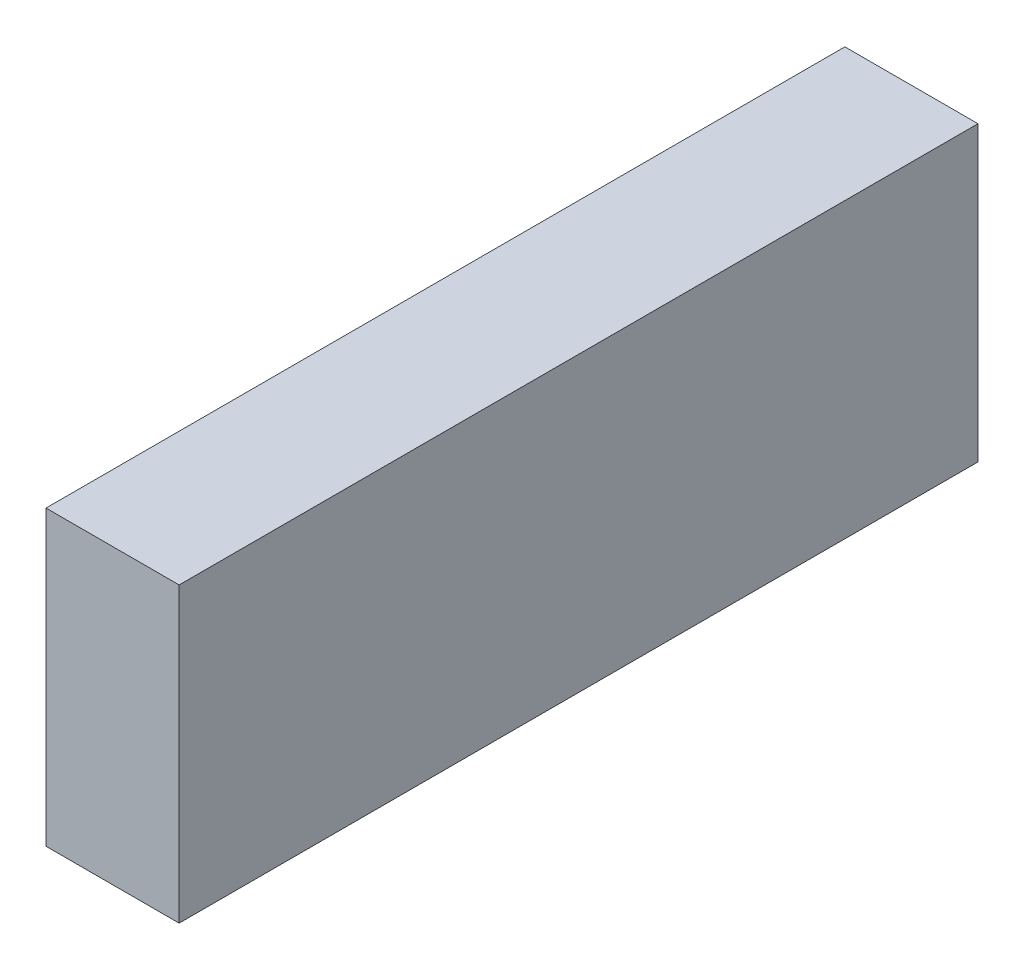
ISO-10303-21;
HEADER;
FILE_DESCRIPTION(('STEP AP214'),'2;1');
FILE_NAME('part.step','',(''),(''),'','','');
FILE_SCHEMA(('AUTOMOTIVE_DESIGN { 1 0 10303 214 1 1 1 1 }'));
ENDSEC;
DATA;
#1=APPLICATION_CONTEXT('core data for automotive mechanical design processes');
#2=APPLICATION_PROTOCOL_DEFINITION('international standard','automotive_design',2000,#1);
#3=PRODUCT_CONTEXT('',#1,'mechanical');
#4=PRODUCT('Part','Part','',(#3));
#5=PRODUCT_RELATED_PRODUCT_CATEGORY('part','',(#4));
#6=PRODUCT_DEFINITION_FORMATION('','',#4);
#7=PRODUCT_DEFINITION_CONTEXT('part definition',#1,'design');
#8=PRODUCT_DEFINITION('design','',#6,#7);
#9=PRODUCT_DEFINITION_SHAPE('','',#8);
#10=(LENGTH_UNIT() NAMED_UNIT(*) SI_UNIT(.MILLI.,.METRE.));
#11=(NAMED_UNIT(*) PLANE_ANGLE_UNIT() SI_UNIT($,.RADIAN.));
#12=(NAMED_UNIT(*) SI_UNIT($,.STERADIAN.) SOLID_ANGLE_UNIT());
#13=UNCERTAINTY_MEASURE_WITH_UNIT(LENGTH_MEASURE(1.E-05),#10,'distance_accuracy_value','');
#14=(GEOMETRIC_REPRESENTATION_CONTEXT(3) GLOBAL_UNCERTAINTY_ASSIGNED_CONTEXT((#13)) GLOBAL_UNIT_ASSIGNED_CONTEXT((#10,
#11,#12)) REPRESENTATION_CONTEXT('',''));
#15=CARTESIAN_POINT('',(0.,0.,0.));
#16=DIRECTION('',(0.,0.,1.));
#17=DIRECTION('',(1.,0.,0.));
#18=AXIS2_PLACEMENT_3D('',#15,#16,#17);
#19=CARTESIAN_POINT('',(6.35,6.985,19.05));
#20=DIRECTION('',(0.,0.,-1.));
#21=DIRECTION('',(-1.,0.,0.));
#22=AXIS2_PLACEMENT_3D('',#19,#20,#21);
#23=PLANE('',#22);
#24=DIRECTION('',(0.,-1.,0.));
#25=VECTOR('',#24,1.);
#26=CARTESIAN_POINT('',(0.,6.985,19.05));
#27=LINE('',#26,#25);
#28=CARTESIAN_POINT('',(0.,6.985,19.05));
#29=VERTEX_POINT('',#28);
#30=CARTESIAN_POINT('',(0.,-6.985,19.05));
#31=VERTEX_POINT('',#30);
#32=EDGE_CURVE('E99',#29,#31,#27,.T.);
#33=ORIENTED_EDGE('',*,*,#32,.T.);
#34=DIRECTION('',(-1.,0.,0.));
#35=VECTOR('',#34,1.);
#36=CARTESIAN_POINT('',(6.35,-6.985,19.05));
#37=LINE('',#36,#35);
#38=CARTESIAN_POINT('',(6.35,-6.985,19.05));
#39=VERTEX_POINT('',#38);
#40=EDGE_CURVE('E11',#39,#31,#37,.T.);
#41=ORIENTED_EDGE('',*,*,#40,.F.);
#42=DIRECTION('',(0.,-1.,0.));
#43=VECTOR('',#42,1.);
#44=CARTESIAN_POINT('',(6.35,6.985,19.05));
#45=LINE('',#44,#43);
#46=CARTESIAN_POINT('',(6.35,6.985,19.05));
#47=VERTEX_POINT('',#46);
#48=EDGE_CURVE('E87',#47,#39,#45,.T.);
#49=ORIENTED_EDGE('',*,*,#48,.F.);
#50=DIRECTION('',(-1.,0.,0.));
#51=VECTOR('',#50,1.);
#52=CARTESIAN_POINT('',(6.35,6.985,19.05));
#53=LINE('',#52,#51);
#54=EDGE_CURVE('E95',#47,#29,#53,.T.);
#55=ORIENTED_EDGE('',*,*,#54,.T.);
#56=EDGE_LOOP('',(#33,#41,#49,#55));
#57=FACE_BOUND('',#56,.T.);
#58=ADVANCED_FACE('F36',(#57),#23,.F.);
#59=CARTESIAN_POINT('',(6.35,-6.985,19.05));
#60=DIRECTION('',(0.,1.,0.));
#61=DIRECTION('',(0.,0.,1.));
#62=AXIS2_PLACEMENT_3D('',#59,#60,#61);
#63=PLANE('',#62);
#64=DIRECTION('',(0.,0.,-1.));
#65=VECTOR('',#64,1.);
#66=CARTESIAN_POINT('',(0.,-6.985,19.05));
#67=LINE('',#66,#65);
#68=CARTESIAN_POINT('',(0.,-6.985,-19.05));
#69=VERTEX_POINT('',#68);
#70=EDGE_CURVE('E91',#31,#69,#67,.T.);
#71=ORIENTED_EDGE('',*,*,#70,.T.);
#72=DIRECTION('',(-1.,0.,0.));
#73=VECTOR('',#72,1.);
#74=CARTESIAN_POINT('',(6.35,-6.985,-19.05));
#75=LINE('',#74,#73);
#76=CARTESIAN_POINT('',(6.35,-6.985,-19.05));
#77=VERTEX_POINT('',#76);
#78=EDGE_CURVE('E44',#77,#69,#75,.T.);
#79=ORIENTED_EDGE('',*,*,#78,.F.);
#80=DIRECTION('',(0.,0.,-1.));
#81=VECTOR('',#80,1.);
#82=CARTESIAN_POINT('',(6.35,-6.985,19.05));
#83=LINE('',#82,#81);
#84=EDGE_CURVE('E82',#39,#77,#83,.T.);
#85=ORIENTED_EDGE('',*,*,#84,.F.);
#86=ORIENTED_EDGE('',*,*,#40,.T.);
#87=EDGE_LOOP('',(#71,#79,#85,#86));
#88=FACE_BOUND('',#87,.T.);
#89=ADVANCED_FACE('F90',(#88),#63,.F.);
#90=CARTESIAN_POINT('',(6.35,6.985,-19.05));
#91=DIRECTION('',(0.,0.,1.));
#92=DIRECTION('',(1.,0.,0.));
#93=AXIS2_PLACEMENT_3D('',#90,#91,#92);
#94=PLANE('',#93);
#95=DIRECTION('',(0.,1.,0.));
#96=VECTOR('',#95,1.);
#97=CARTESIAN_POINT('',(0.,6.985,-19.05));
#98=LINE('',#97,#96);
#99=CARTESIAN_POINT('',(0.,6.985,-19.05));
#100=VERTEX_POINT('',#99);
#101=EDGE_CURVE('E69',#69,#100,#98,.T.);
#102=ORIENTED_EDGE('',*,*,#101,.T.);
#103=DIRECTION('',(-1.,0.,0.));
#104=VECTOR('',#103,1.);
#105=CARTESIAN_POINT('',(6.35,6.985,-19.05));
#106=LINE('',#105,#104);
#107=CARTESIAN_POINT('',(6.35,6.985,-19.05));
#108=VERTEX_POINT('',#107);
#109=EDGE_CURVE('E92',#108,#100,#106,.T.);
#110=ORIENTED_EDGE('',*,*,#109,.F.);
#111=DIRECTION('',(0.,1.,0.));
#112=VECTOR('',#111,1.);
#113=CARTESIAN_POINT('',(6.35,6.985,-19.05));
#114=LINE('',#113,#112);
#115=EDGE_CURVE('E85',#77,#108,#114,.T.);
#116=ORIENTED_EDGE('',*,*,#115,.F.);
#117=ORIENTED_EDGE('',*,*,#78,.T.);
#118=EDGE_LOOP('',(#102,#110,#116,#117));
#119=FACE_BOUND('',#118,.T.);
#120=ADVANCED_FACE('F93',(#119),#94,.F.);
#121=CARTESIAN_POINT('',(6.35,6.985,19.05));
#122=DIRECTION('',(0.,-1.,0.));
#123=DIRECTION('',(0.,0.,-1.));
#124=AXIS2_PLACEMENT_3D('',#121,#122,#123);
#125=PLANE('',#124);
#126=DIRECTION('',(0.,0.,1.));
#127=VECTOR('',#126,1.);
#128=CARTESIAN_POINT('',(0.,6.985,19.05));
#129=LINE('',#128,#127);
#130=EDGE_CURVE('E75',#100,#29,#129,.T.);
#131=ORIENTED_EDGE('',*,*,#130,.T.);
#132=ORIENTED_EDGE('',*,*,#54,.F.);
#133=DIRECTION('',(0.,0.,1.));
#134=VECTOR('',#133,1.);
#135=CARTESIAN_POINT('',(6.35,6.985,19.05));
#136=LINE('',#135,#134);
#137=EDGE_CURVE('E52',#108,#47,#136,.T.);
#138=ORIENTED_EDGE('',*,*,#137,.F.);
#139=ORIENTED_EDGE('',*,*,#109,.T.);
#140=EDGE_LOOP('',(#131,#132,#138,#139));
#141=FACE_BOUND('',#140,.T.);
#142=ADVANCED_FACE('F106',(#141),#125,.F.);
#143=CARTESIAN_POINT('',(6.35,0.,0.));
#144=DIRECTION('',(1.,0.,0.));
#145=DIRECTION('',(0.,0.,-1.));
#146=AXIS2_PLACEMENT_3D('',#143,#144,#145);
#147=PLANE('',#146);
#148=ORIENTED_EDGE('',*,*,#48,.T.);
#149=ORIENTED_EDGE('',*,*,#84,.T.);
#150=ORIENTED_EDGE('',*,*,#115,.T.);
#151=ORIENTED_EDGE('',*,*,#137,.T.);
#152=EDGE_LOOP('',(#148,#149,#150,#151));
#153=FACE_BOUND('',#152,.T.);
#154=ADVANCED_FACE('F83',(#153),#147,.T.);
#155=CARTESIAN_POINT('',(0.,0.,0.));
#156=DIRECTION('',(1.,0.,0.));
#157=DIRECTION('',(0.,0.,-1.));
#158=AXIS2_PLACEMENT_3D('',#155,#156,#157);
#159=PLANE('',#158);
#160=ORIENTED_EDGE('',*,*,#32,.F.);
#161=ORIENTED_EDGE('',*,*,#130,.F.);
#162=ORIENTED_EDGE('',*,*,#101,.F.);
#163=ORIENTED_EDGE('',*,*,#70,.F.);
#164=EDGE_LOOP('',(#160,#161,#162,#163));
#165=FACE_BOUND('',#164,.T.);
#166=ADVANCED_FACE('F109',(#165),#159,.F.);
#167=CLOSED_SHELL('',(#58,#89,#120,#142,#154,#166));
#168=MANIFOLD_SOLID_BREP('B2',#167);
#169=ADVANCED_BREP_SHAPE_REPRESENTATION('',(#18,#168),#14);
#170=SHAPE_DEFINITION_REPRESENTATION(#9,#169);
ENDSEC;
END-ISO-10303-21;
